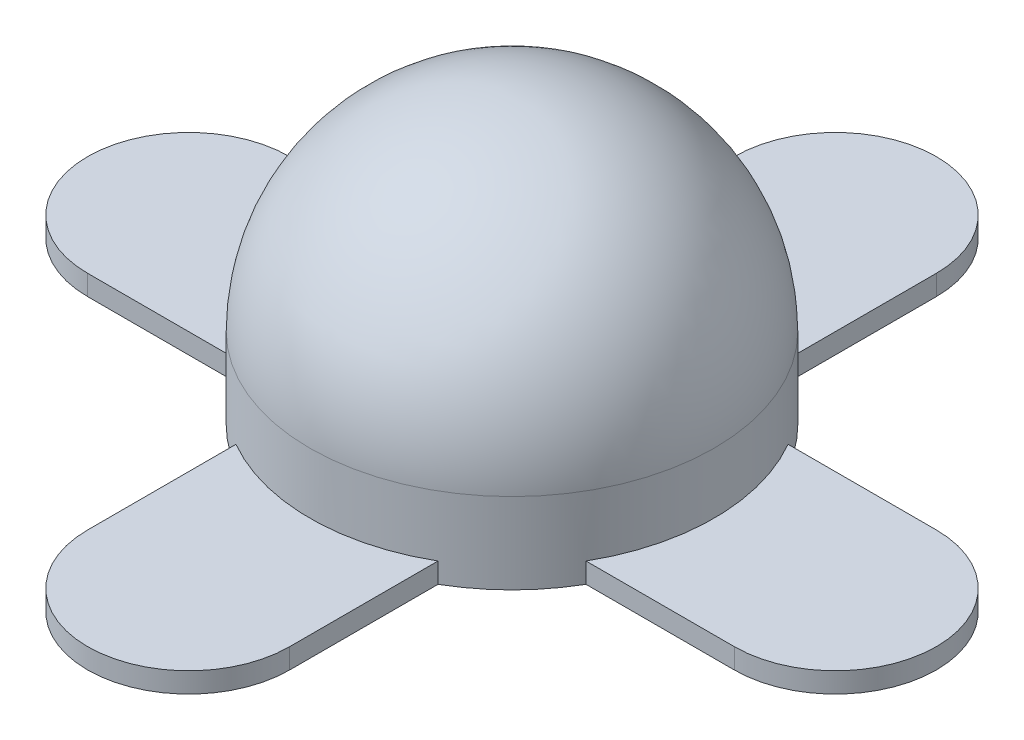
ISO-10303-21;
HEADER;
FILE_DESCRIPTION(('STEP AP214'),'2;1');
FILE_NAME('part.step','',(''),(''),'','','');
FILE_SCHEMA(('AUTOMOTIVE_DESIGN { 1 0 10303 214 1 1 1 1 }'));
ENDSEC;
DATA;
#1=APPLICATION_CONTEXT('core data for automotive mechanical design processes');
#2=APPLICATION_PROTOCOL_DEFINITION('international standard','automotive_design',2000,#1);
#3=PRODUCT_CONTEXT('',#1,'mechanical');
#4=PRODUCT('Part','Part','',(#3));
#5=PRODUCT_RELATED_PRODUCT_CATEGORY('part','',(#4));
#6=PRODUCT_DEFINITION_FORMATION('','',#4);
#7=PRODUCT_DEFINITION_CONTEXT('part definition',#1,'design');
#8=PRODUCT_DEFINITION('design','',#6,#7);
#9=PRODUCT_DEFINITION_SHAPE('','',#8);
#10=(LENGTH_UNIT() NAMED_UNIT(*) SI_UNIT(.MILLI.,.METRE.));
#11=(NAMED_UNIT(*) PLANE_ANGLE_UNIT() SI_UNIT($,.RADIAN.));
#12=(NAMED_UNIT(*) SI_UNIT($,.STERADIAN.) SOLID_ANGLE_UNIT());
#13=UNCERTAINTY_MEASURE_WITH_UNIT(LENGTH_MEASURE(1.E-05),#10,'distance_accuracy_value','');
#14=(GEOMETRIC_REPRESENTATION_CONTEXT(3) GLOBAL_UNCERTAINTY_ASSIGNED_CONTEXT((#13)) GLOBAL_UNIT_ASSIGNED_CONTEXT((#10,
#11,#12)) REPRESENTATION_CONTEXT('',''));
#15=CARTESIAN_POINT('',(0.,0.,0.));
#16=DIRECTION('',(0.,0.,1.));
#17=DIRECTION('',(1.,0.,0.));
#18=AXIS2_PLACEMENT_3D('',#15,#16,#17);
#19=CARTESIAN_POINT('',(0.,7.,0.));
#20=DIRECTION('',(0.,-1.,0.));
#21=DIRECTION('',(0.,0.,-1.));
#22=AXIS2_PLACEMENT_3D('',#19,#20,#21);
#23=CYLINDRICAL_SURFACE('',#22,5.);
#24=CARTESIAN_POINT('',(0.,2.,0.));
#25=DIRECTION('',(0.,-1.,0.));
#26=DIRECTION('',(0.,0.,-1.));
#27=AXIS2_PLACEMENT_3D('',#24,#25,#26);
#28=CIRCLE('',#27,5.);
#29=CARTESIAN_POINT('',(0.,2.,-5.));
#30=VERTEX_POINT('',#29);
#31=EDGE_CURVE('E11',#30,#30,#28,.T.);
#32=ORIENTED_EDGE('',*,*,#31,.T.);
#33=EDGE_LOOP('',(#32));
#34=FACE_BOUND('',#33,.T.);
#35=DIRECTION('',(0.,-1.,0.));
#36=VECTOR('',#35,1.);
#37=CARTESIAN_POINT('',(-2.50000000000003,0.5,-4.33012701892218));
#38=LINE('',#37,#36);
#39=CARTESIAN_POINT('',(-2.50000000000003,0.5,-4.33012701892218));
#40=VERTEX_POINT('',#39);
#41=CARTESIAN_POINT('',(-2.50000000000003,0.,-4.33012701892218));
#42=VERTEX_POINT('',#41);
#43=EDGE_CURVE('E180',#40,#42,#38,.T.);
#44=ORIENTED_EDGE('',*,*,#43,.T.);
#45=CARTESIAN_POINT('',(0.,0.,0.));
#46=DIRECTION('',(0.,1.,0.));
#47=DIRECTION('',(0.,0.,1.));
#48=AXIS2_PLACEMENT_3D('',#45,#46,#47);
#49=CIRCLE('',#48,5.);
#50=CARTESIAN_POINT('',(-4.33012701892222,0.,-2.49999999999995));
#51=VERTEX_POINT('',#50);
#52=EDGE_CURVE('E275',#42,#51,#49,.T.);
#53=ORIENTED_EDGE('',*,*,#52,.T.);
#54=DIRECTION('',(0.,-1.,0.));
#55=VECTOR('',#54,1.);
#56=CARTESIAN_POINT('',(-4.33012701892222,0.5,-2.49999999999995));
#57=LINE('',#56,#55);
#58=CARTESIAN_POINT('',(-4.33012701892222,0.5,-2.49999999999995));
#59=VERTEX_POINT('',#58);
#60=EDGE_CURVE('E209',#59,#51,#57,.T.);
#61=ORIENTED_EDGE('',*,*,#60,.F.);
#62=CARTESIAN_POINT('',(0.,0.5,0.));
#63=DIRECTION('',(0.,-1.,0.));
#64=DIRECTION('',(0.,0.,-1.));
#65=AXIS2_PLACEMENT_3D('',#62,#63,#64);
#66=CIRCLE('',#65,5.);
#67=CARTESIAN_POINT('',(-4.33012701892217,0.5,2.50000000000005));
#68=VERTEX_POINT('',#67);
#69=EDGE_CURVE('E189',#68,#59,#66,.T.);
#70=ORIENTED_EDGE('',*,*,#69,.F.);
#71=DIRECTION('',(0.,-1.,0.));
#72=VECTOR('',#71,1.);
#73=CARTESIAN_POINT('',(-4.33012701892217,0.5,2.50000000000005));
#74=LINE('',#73,#72);
#75=CARTESIAN_POINT('',(-4.33012701892217,0.,2.50000000000005));
#76=VERTEX_POINT('',#75);
#77=EDGE_CURVE('E206',#68,#76,#74,.T.);
#78=ORIENTED_EDGE('',*,*,#77,.T.);
#79=CARTESIAN_POINT('',(-2.5,0.,4.3301270189222));
#80=VERTEX_POINT('',#79);
#81=EDGE_CURVE('E276',#76,#80,#49,.T.);
#82=ORIENTED_EDGE('',*,*,#81,.T.);
#83=DIRECTION('',(0.,-1.,0.));
#84=VECTOR('',#83,1.);
#85=CARTESIAN_POINT('',(-2.5,0.5,4.3301270189222));
#86=LINE('',#85,#84);
#87=CARTESIAN_POINT('',(-2.5,0.5,4.3301270189222));
#88=VERTEX_POINT('',#87);
#89=EDGE_CURVE('E240',#88,#80,#86,.T.);
#90=ORIENTED_EDGE('',*,*,#89,.F.);
#91=CARTESIAN_POINT('',(0.,0.5,0.));
#92=DIRECTION('',(0.,-1.,0.));
#93=DIRECTION('',(0.,0.,-1.));
#94=AXIS2_PLACEMENT_3D('',#91,#92,#93);
#95=CIRCLE('',#94,5.);
#96=CARTESIAN_POINT('',(2.5,0.5,4.33012701892219));
#97=VERTEX_POINT('',#96);
#98=EDGE_CURVE('E220',#97,#88,#95,.T.);
#99=ORIENTED_EDGE('',*,*,#98,.F.);
#100=DIRECTION('',(0.,-1.,0.));
#101=VECTOR('',#100,1.);
#102=CARTESIAN_POINT('',(2.5,0.5,4.33012701892219));
#103=LINE('',#102,#101);
#104=CARTESIAN_POINT('',(2.5,0.,4.33012701892219));
#105=VERTEX_POINT('',#104);
#106=EDGE_CURVE('E237',#97,#105,#103,.T.);
#107=ORIENTED_EDGE('',*,*,#106,.T.);
#108=CARTESIAN_POINT('',(4.3301270189222,0.,2.49999999999998));
#109=VERTEX_POINT('',#108);
#110=EDGE_CURVE('E267',#105,#109,#49,.T.);
#111=ORIENTED_EDGE('',*,*,#110,.T.);
#112=DIRECTION('',(0.,-1.,0.));
#113=VECTOR('',#112,1.);
#114=CARTESIAN_POINT('',(4.3301270189222,0.5,2.49999999999998));
#115=LINE('',#114,#113);
#116=CARTESIAN_POINT('',(4.3301270189222,0.5,2.49999999999998));
#117=VERTEX_POINT('',#116);
#118=EDGE_CURVE('E271',#117,#109,#115,.T.);
#119=ORIENTED_EDGE('',*,*,#118,.F.);
#120=CARTESIAN_POINT('',(0.,0.5,0.));
#121=DIRECTION('',(0.,-1.,0.));
#122=DIRECTION('',(0.,0.,-1.));
#123=AXIS2_PLACEMENT_3D('',#120,#121,#122);
#124=CIRCLE('',#123,5.);
#125=CARTESIAN_POINT('',(4.33012701892218,0.5,-2.50000000000002));
#126=VERTEX_POINT('',#125);
#127=EDGE_CURVE('E251',#126,#117,#124,.T.);
#128=ORIENTED_EDGE('',*,*,#127,.F.);
#129=DIRECTION('',(0.,-1.,0.));
#130=VECTOR('',#129,1.);
#131=CARTESIAN_POINT('',(4.33012701892218,0.5,-2.50000000000002));
#132=LINE('',#131,#130);
#133=CARTESIAN_POINT('',(4.33012701892218,0.,-2.50000000000002));
#134=VERTEX_POINT('',#133);
#135=EDGE_CURVE('E268',#126,#134,#132,.T.);
#136=ORIENTED_EDGE('',*,*,#135,.T.);
#137=CARTESIAN_POINT('',(2.49999999999997,0.,-4.33012701892221));
#138=VERTEX_POINT('',#137);
#139=EDGE_CURVE('E43',#134,#138,#49,.T.);
#140=ORIENTED_EDGE('',*,*,#139,.T.);
#141=DIRECTION('',(0.,-1.,0.));
#142=VECTOR('',#141,1.);
#143=CARTESIAN_POINT('',(2.49999999999997,0.5,-4.33012701892221));
#144=LINE('',#143,#142);
#145=CARTESIAN_POINT('',(2.49999999999997,0.5,-4.33012701892221));
#146=VERTEX_POINT('',#145);
#147=EDGE_CURVE('E50',#146,#138,#144,.T.);
#148=ORIENTED_EDGE('',*,*,#147,.F.);
#149=CARTESIAN_POINT('',(0.,0.5,0.));
#150=DIRECTION('',(0.,-1.,0.));
#151=DIRECTION('',(0.,0.,-1.));
#152=AXIS2_PLACEMENT_3D('',#149,#150,#151);
#153=CIRCLE('',#152,5.);
#154=EDGE_CURVE('E54',#40,#146,#153,.T.);
#155=ORIENTED_EDGE('',*,*,#154,.F.);
#156=EDGE_LOOP('',(#44,#53,#61,#70,#78,#82,#90,#99,#107,#111,#119,#128,#136,#140,#148,#155));
#157=FACE_BOUND('',#156,.T.);
#158=ADVANCED_FACE('F35',(#34,#157),#23,.T.);
#159=CARTESIAN_POINT('',(0.,0.,0.));
#160=DIRECTION('',(0.,1.,0.));
#161=DIRECTION('',(0.,0.,1.));
#162=AXIS2_PLACEMENT_3D('',#159,#160,#161);
#163=PLANE('',#162);
#164=ORIENTED_EDGE('',*,*,#139,.F.);
#165=DIRECTION('',(-1.,0.,0.));
#166=VECTOR('',#165,1.);
#167=CARTESIAN_POINT('',(0.,0.,-2.5));
#168=LINE('',#167,#166);
#169=CARTESIAN_POINT('',(7.99999999999999,0.,-2.50000000000003));
#170=VERTEX_POINT('',#169);
#171=EDGE_CURVE('E249',#170,#134,#168,.T.);
#172=ORIENTED_EDGE('',*,*,#171,.F.);
#173=CARTESIAN_POINT('',(8.,0.,0.));
#174=DIRECTION('',(0.,-1.,0.));
#175=DIRECTION('',(0.,0.,-1.));
#176=AXIS2_PLACEMENT_3D('',#173,#174,#175);
#177=CIRCLE('',#176,2.5);
#178=CARTESIAN_POINT('',(8.00000000000001,0.,2.49999999999997));
#179=VERTEX_POINT('',#178);
#180=EDGE_CURVE('E236',#179,#170,#177,.F.);
#181=ORIENTED_EDGE('',*,*,#180,.F.);
#182=DIRECTION('',(1.,0.,0.));
#183=VECTOR('',#182,1.);
#184=CARTESIAN_POINT('',(0.,0.,2.5));
#185=LINE('',#184,#183);
#186=EDGE_CURVE('E260',#109,#179,#185,.T.);
#187=ORIENTED_EDGE('',*,*,#186,.F.);
#188=ORIENTED_EDGE('',*,*,#110,.F.);
#189=DIRECTION('',(0.,0.,-1.));
#190=VECTOR('',#189,1.);
#191=CARTESIAN_POINT('',(2.5,0.,0.));
#192=LINE('',#191,#190);
#193=CARTESIAN_POINT('',(2.5,0.,8.));
#194=VERTEX_POINT('',#193);
#195=EDGE_CURVE('E218',#194,#105,#192,.T.);
#196=ORIENTED_EDGE('',*,*,#195,.F.);
#197=CARTESIAN_POINT('',(0.,0.,8.));
#198=DIRECTION('',(0.,-1.,0.));
#199=DIRECTION('',(0.,0.,-1.));
#200=AXIS2_PLACEMENT_3D('',#197,#198,#199);
#201=CIRCLE('',#200,2.5);
#202=CARTESIAN_POINT('',(-2.5,0.,8.));
#203=VERTEX_POINT('',#202);
#204=EDGE_CURVE('E205',#203,#194,#201,.F.);
#205=ORIENTED_EDGE('',*,*,#204,.F.);
#206=DIRECTION('',(0.,0.,1.));
#207=VECTOR('',#206,1.);
#208=CARTESIAN_POINT('',(-2.5,0.,0.));
#209=LINE('',#208,#207);
#210=EDGE_CURVE('E229',#80,#203,#209,.T.);
#211=ORIENTED_EDGE('',*,*,#210,.F.);
#212=ORIENTED_EDGE('',*,*,#81,.F.);
#213=DIRECTION('',(1.,0.,0.));
#214=VECTOR('',#213,1.);
#215=CARTESIAN_POINT('',(0.,0.,2.5));
#216=LINE('',#215,#214);
#217=CARTESIAN_POINT('',(-7.99999999999997,0.,2.50000000000008));
#218=VERTEX_POINT('',#217);
#219=EDGE_CURVE('E187',#218,#76,#216,.T.);
#220=ORIENTED_EDGE('',*,*,#219,.F.);
#221=CARTESIAN_POINT('',(-8.,0.,0.));
#222=DIRECTION('',(0.,-1.,0.));
#223=DIRECTION('',(0.,0.,-1.));
#224=AXIS2_PLACEMENT_3D('',#221,#222,#223);
#225=CIRCLE('',#224,2.5);
#226=CARTESIAN_POINT('',(-8.00000000000002,0.,-2.49999999999992));
#227=VERTEX_POINT('',#226);
#228=EDGE_CURVE('E179',#227,#218,#225,.F.);
#229=ORIENTED_EDGE('',*,*,#228,.F.);
#230=DIRECTION('',(-1.,0.,0.));
#231=VECTOR('',#230,1.);
#232=CARTESIAN_POINT('',(0.,0.,-2.5));
#233=LINE('',#232,#231);
#234=EDGE_CURVE('E198',#51,#227,#233,.T.);
#235=ORIENTED_EDGE('',*,*,#234,.F.);
#236=ORIENTED_EDGE('',*,*,#52,.F.);
#237=DIRECTION('',(0.,0.,1.));
#238=VECTOR('',#237,1.);
#239=CARTESIAN_POINT('',(-2.5,0.,0.));
#240=LINE('',#239,#238);
#241=CARTESIAN_POINT('',(-2.50000000000006,0.,-7.99999999999998));
#242=VERTEX_POINT('',#241);
#243=EDGE_CURVE('E168',#242,#42,#240,.T.);
#244=ORIENTED_EDGE('',*,*,#243,.F.);
#245=CARTESIAN_POINT('',(0.,0.,-8.));
#246=DIRECTION('',(0.,-1.,0.));
#247=DIRECTION('',(0.,0.,-1.));
#248=AXIS2_PLACEMENT_3D('',#245,#246,#247);
#249=CIRCLE('',#248,2.5);
#250=CARTESIAN_POINT('',(2.49999999999994,0.,-8.00000000000002));
#251=VERTEX_POINT('',#250);
#252=EDGE_CURVE('E175',#251,#242,#249,.F.);
#253=ORIENTED_EDGE('',*,*,#252,.F.);
#254=DIRECTION('',(0.,0.,-1.));
#255=VECTOR('',#254,1.);
#256=CARTESIAN_POINT('',(2.5,0.,0.));
#257=LINE('',#256,#255);
#258=EDGE_CURVE('E159',#138,#251,#257,.T.);
#259=ORIENTED_EDGE('',*,*,#258,.F.);
#260=EDGE_LOOP('',(#164,#172,#181,#187,#188,#196,#205,#211,#212,#220,#229,#235,#236,#244,#253,#259));
#261=FACE_BOUND('',#260,.T.);
#262=ADVANCED_FACE('F285',(#261),#163,.F.);
#263=CARTESIAN_POINT('',(0.,2.,0.));
#264=DIRECTION('',(0.,1.,0.));
#265=DIRECTION('',(0.,0.,1.));
#266=AXIS2_PLACEMENT_3D('',#263,#264,#265);
#267=SPHERICAL_SURFACE('',#266,5.);
#268=ORIENTED_EDGE('',*,*,#31,.F.);
#269=EDGE_LOOP('',(#268));
#270=FACE_BOUND('',#269,.T.);
#271=ADVANCED_FACE('F37',(#270),#267,.T.);
#272=CARTESIAN_POINT('',(8.,0.5,0.));
#273=DIRECTION('',(0.,-1.,0.));
#274=DIRECTION('',(0.,0.,-1.));
#275=AXIS2_PLACEMENT_3D('',#272,#273,#274);
#276=CYLINDRICAL_SURFACE('',#275,2.5);
#277=ORIENTED_EDGE('',*,*,#180,.T.);
#278=DIRECTION('',(0.,-1.,0.));
#279=VECTOR('',#278,1.);
#280=CARTESIAN_POINT('',(7.99999999999999,0.5,-2.50000000000003));
#281=LINE('',#280,#279);
#282=CARTESIAN_POINT('',(7.99999999999999,0.5,-2.50000000000003));
#283=VERTEX_POINT('',#282);
#284=EDGE_CURVE('E264',#283,#170,#281,.T.);
#285=ORIENTED_EDGE('',*,*,#284,.F.);
#286=CARTESIAN_POINT('',(8.,0.5,0.));
#287=DIRECTION('',(0.,-1.,0.));
#288=DIRECTION('',(0.,0.,-1.));
#289=AXIS2_PLACEMENT_3D('',#286,#287,#288);
#290=CIRCLE('',#289,2.5);
#291=CARTESIAN_POINT('',(8.00000000000001,0.5,2.49999999999997));
#292=VERTEX_POINT('',#291);
#293=EDGE_CURVE('E245',#292,#283,#290,.F.);
#294=ORIENTED_EDGE('',*,*,#293,.F.);
#295=DIRECTION('',(0.,-1.,0.));
#296=VECTOR('',#295,1.);
#297=CARTESIAN_POINT('',(8.00000000000001,0.5,2.49999999999997));
#298=LINE('',#297,#296);
#299=EDGE_CURVE('E257',#292,#179,#298,.T.);
#300=ORIENTED_EDGE('',*,*,#299,.T.);
#301=EDGE_LOOP('',(#277,#285,#294,#300));
#302=FACE_BOUND('',#301,.T.);
#303=ADVANCED_FACE('F312',(#302),#276,.T.);
#304=CARTESIAN_POINT('',(0.,0.5,-2.5));
#305=DIRECTION('',(0.,0.,1.));
#306=DIRECTION('',(1.,0.,0.));
#307=AXIS2_PLACEMENT_3D('',#304,#305,#306);
#308=PLANE('',#307);
#309=ORIENTED_EDGE('',*,*,#171,.T.);
#310=ORIENTED_EDGE('',*,*,#135,.F.);
#311=DIRECTION('',(-1.,0.,0.));
#312=VECTOR('',#311,1.);
#313=CARTESIAN_POINT('',(0.,0.5,-2.5));
#314=LINE('',#313,#312);
#315=EDGE_CURVE('E254',#283,#126,#314,.T.);
#316=ORIENTED_EDGE('',*,*,#315,.F.);
#317=ORIENTED_EDGE('',*,*,#284,.T.);
#318=EDGE_LOOP('',(#309,#310,#316,#317));
#319=FACE_BOUND('',#318,.T.);
#320=ADVANCED_FACE('F315',(#319),#308,.F.);
#321=CARTESIAN_POINT('',(0.,0.5,2.5));
#322=DIRECTION('',(0.,0.,-1.));
#323=DIRECTION('',(-1.,0.,0.));
#324=AXIS2_PLACEMENT_3D('',#321,#322,#323);
#325=PLANE('',#324);
#326=ORIENTED_EDGE('',*,*,#186,.T.);
#327=ORIENTED_EDGE('',*,*,#299,.F.);
#328=DIRECTION('',(1.,0.,0.));
#329=VECTOR('',#328,1.);
#330=CARTESIAN_POINT('',(0.,0.5,2.5));
#331=LINE('',#330,#329);
#332=EDGE_CURVE('E248',#117,#292,#331,.T.);
#333=ORIENTED_EDGE('',*,*,#332,.F.);
#334=ORIENTED_EDGE('',*,*,#118,.T.);
#335=EDGE_LOOP('',(#326,#327,#333,#334));
#336=FACE_BOUND('',#335,.T.);
#337=ADVANCED_FACE('F317',(#336),#325,.F.);
#338=CARTESIAN_POINT('',(0.,0.5,0.));
#339=DIRECTION('',(0.,-1.,0.));
#340=DIRECTION('',(0.,0.,-1.));
#341=AXIS2_PLACEMENT_3D('',#338,#339,#340);
#342=PLANE('',#341);
#343=ORIENTED_EDGE('',*,*,#293,.T.);
#344=ORIENTED_EDGE('',*,*,#315,.T.);
#345=ORIENTED_EDGE('',*,*,#127,.T.);
#346=ORIENTED_EDGE('',*,*,#332,.T.);
#347=EDGE_LOOP('',(#343,#344,#345,#346));
#348=FACE_BOUND('',#347,.T.);
#349=ADVANCED_FACE('F302',(#348),#342,.F.);
#350=CARTESIAN_POINT('',(0.,0.5,8.));
#351=DIRECTION('',(0.,-1.,0.));
#352=DIRECTION('',(0.,0.,-1.));
#353=AXIS2_PLACEMENT_3D('',#350,#351,#352);
#354=CYLINDRICAL_SURFACE('',#353,2.5);
#355=ORIENTED_EDGE('',*,*,#204,.T.);
#356=DIRECTION('',(0.,-1.,0.));
#357=VECTOR('',#356,1.);
#358=CARTESIAN_POINT('',(2.5,0.5,8.));
#359=LINE('',#358,#357);
#360=CARTESIAN_POINT('',(2.5,0.5,8.));
#361=VERTEX_POINT('',#360);
#362=EDGE_CURVE('E233',#361,#194,#359,.T.);
#363=ORIENTED_EDGE('',*,*,#362,.F.);
#364=CARTESIAN_POINT('',(0.,0.5,8.));
#365=DIRECTION('',(0.,-1.,0.));
#366=DIRECTION('',(0.,0.,-1.));
#367=AXIS2_PLACEMENT_3D('',#364,#365,#366);
#368=CIRCLE('',#367,2.5);
#369=CARTESIAN_POINT('',(-2.5,0.5,8.));
#370=VERTEX_POINT('',#369);
#371=EDGE_CURVE('E214',#370,#361,#368,.F.);
#372=ORIENTED_EDGE('',*,*,#371,.F.);
#373=DIRECTION('',(0.,-1.,0.));
#374=VECTOR('',#373,1.);
#375=CARTESIAN_POINT('',(-2.5,0.5,8.));
#376=LINE('',#375,#374);
#377=EDGE_CURVE('E226',#370,#203,#376,.T.);
#378=ORIENTED_EDGE('',*,*,#377,.T.);
#379=EDGE_LOOP('',(#355,#363,#372,#378));
#380=FACE_BOUND('',#379,.T.);
#381=ADVANCED_FACE('F288',(#380),#354,.T.);
#382=CARTESIAN_POINT('',(2.5,0.5,0.));
#383=DIRECTION('',(-1.,0.,0.));
#384=DIRECTION('',(0.,0.,1.));
#385=AXIS2_PLACEMENT_3D('',#382,#383,#384);
#386=PLANE('',#385);
#387=ORIENTED_EDGE('',*,*,#195,.T.);
#388=ORIENTED_EDGE('',*,*,#106,.F.);
#389=DIRECTION('',(0.,0.,-1.));
#390=VECTOR('',#389,1.);
#391=CARTESIAN_POINT('',(2.5,0.5,0.));
#392=LINE('',#391,#390);
#393=EDGE_CURVE('E223',#361,#97,#392,.T.);
#394=ORIENTED_EDGE('',*,*,#393,.F.);
#395=ORIENTED_EDGE('',*,*,#362,.T.);
#396=EDGE_LOOP('',(#387,#388,#394,#395));
#397=FACE_BOUND('',#396,.T.);
#398=ADVANCED_FACE('F294',(#397),#386,.F.);
#399=CARTESIAN_POINT('',(-2.5,0.5,0.));
#400=DIRECTION('',(1.,0.,0.));
#401=DIRECTION('',(0.,0.,-1.));
#402=AXIS2_PLACEMENT_3D('',#399,#400,#401);
#403=PLANE('',#402);
#404=ORIENTED_EDGE('',*,*,#210,.T.);
#405=ORIENTED_EDGE('',*,*,#377,.F.);
#406=DIRECTION('',(0.,0.,1.));
#407=VECTOR('',#406,1.);
#408=CARTESIAN_POINT('',(-2.5,0.5,0.));
#409=LINE('',#408,#407);
#410=EDGE_CURVE('E217',#88,#370,#409,.T.);
#411=ORIENTED_EDGE('',*,*,#410,.F.);
#412=ORIENTED_EDGE('',*,*,#89,.T.);
#413=EDGE_LOOP('',(#404,#405,#411,#412));
#414=FACE_BOUND('',#413,.T.);
#415=ADVANCED_FACE('F282',(#414),#403,.F.);
#416=CARTESIAN_POINT('',(0.,0.5,0.));
#417=DIRECTION('',(0.,-1.,0.));
#418=DIRECTION('',(0.,0.,-1.));
#419=AXIS2_PLACEMENT_3D('',#416,#417,#418);
#420=PLANE('',#419);
#421=ORIENTED_EDGE('',*,*,#371,.T.);
#422=ORIENTED_EDGE('',*,*,#393,.T.);
#423=ORIENTED_EDGE('',*,*,#98,.T.);
#424=ORIENTED_EDGE('',*,*,#410,.T.);
#425=EDGE_LOOP('',(#421,#422,#423,#424));
#426=FACE_BOUND('',#425,.T.);
#427=ADVANCED_FACE('F291',(#426),#420,.F.);
#428=CARTESIAN_POINT('',(-8.,0.5,0.));
#429=DIRECTION('',(0.,-1.,0.));
#430=DIRECTION('',(0.,0.,-1.));
#431=AXIS2_PLACEMENT_3D('',#428,#429,#430);
#432=CYLINDRICAL_SURFACE('',#431,2.5);
#433=ORIENTED_EDGE('',*,*,#228,.T.);
#434=DIRECTION('',(0.,-1.,0.));
#435=VECTOR('',#434,1.);
#436=CARTESIAN_POINT('',(-7.99999999999997,0.5,2.50000000000008));
#437=LINE('',#436,#435);
#438=CARTESIAN_POINT('',(-7.99999999999997,0.5,2.50000000000008));
#439=VERTEX_POINT('',#438);
#440=EDGE_CURVE('E202',#439,#218,#437,.T.);
#441=ORIENTED_EDGE('',*,*,#440,.F.);
#442=CARTESIAN_POINT('',(-8.,0.5,0.));
#443=DIRECTION('',(0.,-1.,0.));
#444=DIRECTION('',(0.,0.,-1.));
#445=AXIS2_PLACEMENT_3D('',#442,#443,#444);
#446=CIRCLE('',#445,2.5);
#447=CARTESIAN_POINT('',(-8.00000000000002,0.5,-2.49999999999992));
#448=VERTEX_POINT('',#447);
#449=EDGE_CURVE('E183',#448,#439,#446,.F.);
#450=ORIENTED_EDGE('',*,*,#449,.F.);
#451=DIRECTION('',(0.,-1.,0.));
#452=VECTOR('',#451,1.);
#453=CARTESIAN_POINT('',(-8.00000000000002,0.5,-2.49999999999992));
#454=LINE('',#453,#452);
#455=EDGE_CURVE('E195',#448,#227,#454,.T.);
#456=ORIENTED_EDGE('',*,*,#455,.T.);
#457=EDGE_LOOP('',(#433,#441,#450,#456));
#458=FACE_BOUND('',#457,.T.);
#459=ADVANCED_FACE('F346',(#458),#432,.T.);
#460=CARTESIAN_POINT('',(0.,0.5,2.5));
#461=DIRECTION('',(0.,0.,-1.));
#462=DIRECTION('',(-1.,0.,0.));
#463=AXIS2_PLACEMENT_3D('',#460,#461,#462);
#464=PLANE('',#463);
#465=ORIENTED_EDGE('',*,*,#219,.T.);
#466=ORIENTED_EDGE('',*,*,#77,.F.);
#467=DIRECTION('',(1.,0.,0.));
#468=VECTOR('',#467,1.);
#469=CARTESIAN_POINT('',(0.,0.5,2.5));
#470=LINE('',#469,#468);
#471=EDGE_CURVE('E192',#439,#68,#470,.T.);
#472=ORIENTED_EDGE('',*,*,#471,.F.);
#473=ORIENTED_EDGE('',*,*,#440,.T.);
#474=EDGE_LOOP('',(#465,#466,#472,#473));
#475=FACE_BOUND('',#474,.T.);
#476=ADVANCED_FACE('F351',(#475),#464,.F.);
#477=CARTESIAN_POINT('',(0.,0.5,-2.5));
#478=DIRECTION('',(0.,0.,1.));
#479=DIRECTION('',(1.,0.,0.));
#480=AXIS2_PLACEMENT_3D('',#477,#478,#479);
#481=PLANE('',#480);
#482=ORIENTED_EDGE('',*,*,#234,.T.);
#483=ORIENTED_EDGE('',*,*,#455,.F.);
#484=DIRECTION('',(-1.,0.,0.));
#485=VECTOR('',#484,1.);
#486=CARTESIAN_POINT('',(0.,0.5,-2.5));
#487=LINE('',#486,#485);
#488=EDGE_CURVE('E186',#59,#448,#487,.T.);
#489=ORIENTED_EDGE('',*,*,#488,.F.);
#490=ORIENTED_EDGE('',*,*,#60,.T.);
#491=EDGE_LOOP('',(#482,#483,#489,#490));
#492=FACE_BOUND('',#491,.T.);
#493=ADVANCED_FACE('F341',(#492),#481,.F.);
#494=CARTESIAN_POINT('',(0.,0.5,0.));
#495=DIRECTION('',(0.,-1.,0.));
#496=DIRECTION('',(0.,0.,-1.));
#497=AXIS2_PLACEMENT_3D('',#494,#495,#496);
#498=PLANE('',#497);
#499=ORIENTED_EDGE('',*,*,#449,.T.);
#500=ORIENTED_EDGE('',*,*,#471,.T.);
#501=ORIENTED_EDGE('',*,*,#69,.T.);
#502=ORIENTED_EDGE('',*,*,#488,.T.);
#503=EDGE_LOOP('',(#499,#500,#501,#502));
#504=FACE_BOUND('',#503,.T.);
#505=ADVANCED_FACE('F349',(#504),#498,.F.);
#506=CARTESIAN_POINT('',(0.,0.5,-8.));
#507=DIRECTION('',(0.,-1.,0.));
#508=DIRECTION('',(0.,0.,-1.));
#509=AXIS2_PLACEMENT_3D('',#506,#507,#508);
#510=CYLINDRICAL_SURFACE('',#509,2.5);
#511=ORIENTED_EDGE('',*,*,#252,.T.);
#512=DIRECTION('',(0.,-1.,0.));
#513=VECTOR('',#512,1.);
#514=CARTESIAN_POINT('',(-2.50000000000006,0.5,-7.99999999999998));
#515=LINE('',#514,#513);
#516=CARTESIAN_POINT('',(-2.50000000000006,0.5,-7.99999999999998));
#517=VERTEX_POINT('',#516);
#518=EDGE_CURVE('E167',#517,#242,#515,.T.);
#519=ORIENTED_EDGE('',*,*,#518,.F.);
#520=CARTESIAN_POINT('',(0.,0.5,-8.));
#521=DIRECTION('',(0.,-1.,0.));
#522=DIRECTION('',(0.,0.,-1.));
#523=AXIS2_PLACEMENT_3D('',#520,#521,#522);
#524=CIRCLE('',#523,2.5);
#525=CARTESIAN_POINT('',(2.49999999999994,0.5,-8.00000000000002));
#526=VERTEX_POINT('',#525);
#527=EDGE_CURVE('E151',#526,#517,#524,.F.);
#528=ORIENTED_EDGE('',*,*,#527,.F.);
#529=DIRECTION('',(0.,-1.,0.));
#530=VECTOR('',#529,1.);
#531=CARTESIAN_POINT('',(2.49999999999994,0.5,-8.00000000000002));
#532=LINE('',#531,#530);
#533=EDGE_CURVE('E156',#526,#251,#532,.T.);
#534=ORIENTED_EDGE('',*,*,#533,.T.);
#535=EDGE_LOOP('',(#511,#519,#528,#534));
#536=FACE_BOUND('',#535,.T.);
#537=ADVANCED_FACE('F165',(#536),#510,.T.);
#538=CARTESIAN_POINT('',(-2.5,0.5,0.));
#539=DIRECTION('',(1.,0.,0.));
#540=DIRECTION('',(0.,0.,-1.));
#541=AXIS2_PLACEMENT_3D('',#538,#539,#540);
#542=PLANE('',#541);
#543=ORIENTED_EDGE('',*,*,#243,.T.);
#544=ORIENTED_EDGE('',*,*,#43,.F.);
#545=DIRECTION('',(0.,0.,1.));
#546=VECTOR('',#545,1.);
#547=CARTESIAN_POINT('',(-2.5,0.5,0.));
#548=LINE('',#547,#546);
#549=EDGE_CURVE('E163',#517,#40,#548,.T.);
#550=ORIENTED_EDGE('',*,*,#549,.F.);
#551=ORIENTED_EDGE('',*,*,#518,.T.);
#552=EDGE_LOOP('',(#543,#544,#550,#551));
#553=FACE_BOUND('',#552,.T.);
#554=ADVANCED_FACE('F338',(#553),#542,.F.);
#555=CARTESIAN_POINT('',(2.5,0.5,0.));
#556=DIRECTION('',(-1.,0.,0.));
#557=DIRECTION('',(0.,0.,1.));
#558=AXIS2_PLACEMENT_3D('',#555,#556,#557);
#559=PLANE('',#558);
#560=ORIENTED_EDGE('',*,*,#258,.T.);
#561=ORIENTED_EDGE('',*,*,#533,.F.);
#562=DIRECTION('',(0.,0.,-1.));
#563=VECTOR('',#562,1.);
#564=CARTESIAN_POINT('',(2.5,0.5,0.));
#565=LINE('',#564,#563);
#566=EDGE_CURVE('E147',#146,#526,#565,.T.);
#567=ORIENTED_EDGE('',*,*,#566,.F.);
#568=ORIENTED_EDGE('',*,*,#147,.T.);
#569=EDGE_LOOP('',(#560,#561,#567,#568));
#570=FACE_BOUND('',#569,.T.);
#571=ADVANCED_FACE('F157',(#570),#559,.F.);
#572=CARTESIAN_POINT('',(0.,0.5,0.));
#573=DIRECTION('',(0.,-1.,0.));
#574=DIRECTION('',(0.,0.,-1.));
#575=AXIS2_PLACEMENT_3D('',#572,#573,#574);
#576=PLANE('',#575);
#577=ORIENTED_EDGE('',*,*,#527,.T.);
#578=ORIENTED_EDGE('',*,*,#549,.T.);
#579=ORIENTED_EDGE('',*,*,#154,.T.);
#580=ORIENTED_EDGE('',*,*,#566,.T.);
#581=EDGE_LOOP('',(#577,#578,#579,#580));
#582=FACE_BOUND('',#581,.T.);
#583=ADVANCED_FACE('F149',(#582),#576,.F.);
#584=CLOSED_SHELL('',(#158,#262,#271,#303,#320,#337,#349,#381,#398,#415,#427,#459,#476,#493,
#505,#537,#554,#571,#583));
#585=MANIFOLD_SOLID_BREP('B2',#584);
#586=ADVANCED_BREP_SHAPE_REPRESENTATION('',(#18,#585),#14);
#587=SHAPE_DEFINITION_REPRESENTATION(#9,#586);
ENDSEC;
END-ISO-10303-21;
